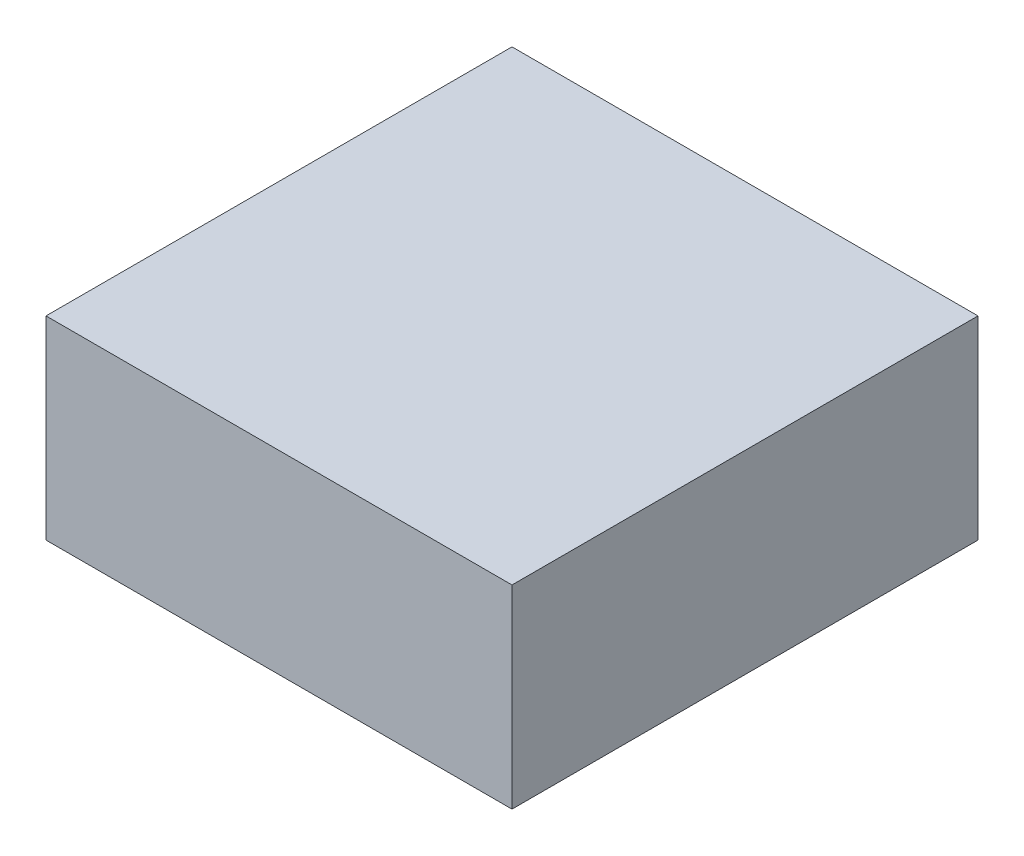
ISO-10303-21;
HEADER;
FILE_DESCRIPTION(('STEP AP214'),'2;1');
FILE_NAME('part.step','',(''),(''),'','','');
FILE_SCHEMA(('AUTOMOTIVE_DESIGN { 1 0 10303 214 1 1 1 1 }'));
ENDSEC;
DATA;
#1=APPLICATION_CONTEXT('core data for automotive mechanical design processes');
#2=APPLICATION_PROTOCOL_DEFINITION('international standard','automotive_design',2000,#1);
#3=PRODUCT_CONTEXT('',#1,'mechanical');
#4=PRODUCT('Part','Part','',(#3));
#5=PRODUCT_RELATED_PRODUCT_CATEGORY('part','',(#4));
#6=PRODUCT_DEFINITION_FORMATION('','',#4);
#7=PRODUCT_DEFINITION_CONTEXT('part definition',#1,'design');
#8=PRODUCT_DEFINITION('design','',#6,#7);
#9=PRODUCT_DEFINITION_SHAPE('','',#8);
#10=(LENGTH_UNIT() NAMED_UNIT(*) SI_UNIT(.MILLI.,.METRE.));
#11=(NAMED_UNIT(*) PLANE_ANGLE_UNIT() SI_UNIT($,.RADIAN.));
#12=(NAMED_UNIT(*) SI_UNIT($,.STERADIAN.) SOLID_ANGLE_UNIT());
#13=UNCERTAINTY_MEASURE_WITH_UNIT(LENGTH_MEASURE(1.E-05),#10,'distance_accuracy_value','');
#14=(GEOMETRIC_REPRESENTATION_CONTEXT(3) GLOBAL_UNCERTAINTY_ASSIGNED_CONTEXT((#13)) GLOBAL_UNIT_ASSIGNED_CONTEXT((#10,
#11,#12)) REPRESENTATION_CONTEXT('',''));
#15=CARTESIAN_POINT('',(0.,0.,0.));
#16=DIRECTION('',(0.,0.,1.));
#17=DIRECTION('',(1.,0.,0.));
#18=AXIS2_PLACEMENT_3D('',#15,#16,#17);
#19=CARTESIAN_POINT('',(18.,15.,-18.));
#20=DIRECTION('',(-1.,0.,0.));
#21=DIRECTION('',(0.,0.,1.));
#22=AXIS2_PLACEMENT_3D('',#19,#20,#21);
#23=PLANE('',#22);
#24=DIRECTION('',(0.,0.,-1.));
#25=VECTOR('',#24,1.);
#26=CARTESIAN_POINT('',(18.,0.,-18.));
#27=LINE('',#26,#25);
#28=CARTESIAN_POINT('',(18.,0.,18.));
#29=VERTEX_POINT('',#28);
#30=CARTESIAN_POINT('',(18.,0.,-18.));
#31=VERTEX_POINT('',#30);
#32=EDGE_CURVE('E107',#29,#31,#27,.T.);
#33=ORIENTED_EDGE('',*,*,#32,.T.);
#34=DIRECTION('',(0.,-1.,0.));
#35=VECTOR('',#34,1.);
#36=CARTESIAN_POINT('',(18.,15.,-18.));
#37=LINE('',#36,#35);
#38=CARTESIAN_POINT('',(18.,15.,-18.));
#39=VERTEX_POINT('',#38);
#40=EDGE_CURVE('E11',#39,#31,#37,.T.);
#41=ORIENTED_EDGE('',*,*,#40,.F.);
#42=DIRECTION('',(0.,0.,-1.));
#43=VECTOR('',#42,1.);
#44=CARTESIAN_POINT('',(18.,15.,-18.));
#45=LINE('',#44,#43);
#46=CARTESIAN_POINT('',(18.,15.,18.));
#47=VERTEX_POINT('',#46);
#48=EDGE_CURVE('E91',#47,#39,#45,.T.);
#49=ORIENTED_EDGE('',*,*,#48,.F.);
#50=DIRECTION('',(0.,-1.,0.));
#51=VECTOR('',#50,1.);
#52=CARTESIAN_POINT('',(18.,15.,18.));
#53=LINE('',#52,#51);
#54=EDGE_CURVE('E103',#47,#29,#53,.T.);
#55=ORIENTED_EDGE('',*,*,#54,.T.);
#56=EDGE_LOOP('',(#33,#41,#49,#55));
#57=FACE_BOUND('',#56,.T.);
#58=ADVANCED_FACE('F39',(#57),#23,.F.);
#59=CARTESIAN_POINT('',(-18.,15.,-18.));
#60=DIRECTION('',(0.,0.,1.));
#61=DIRECTION('',(1.,0.,0.));
#62=AXIS2_PLACEMENT_3D('',#59,#60,#61);
#63=PLANE('',#62);
#64=DIRECTION('',(-1.,0.,0.));
#65=VECTOR('',#64,1.);
#66=CARTESIAN_POINT('',(-18.,0.,-18.));
#67=LINE('',#66,#65);
#68=CARTESIAN_POINT('',(-18.,0.,-18.));
#69=VERTEX_POINT('',#68);
#70=EDGE_CURVE('E96',#31,#69,#67,.T.);
#71=ORIENTED_EDGE('',*,*,#70,.T.);
#72=DIRECTION('',(0.,-1.,0.));
#73=VECTOR('',#72,1.);
#74=CARTESIAN_POINT('',(-18.,15.,-18.));
#75=LINE('',#74,#73);
#76=CARTESIAN_POINT('',(-18.,15.,-18.));
#77=VERTEX_POINT('',#76);
#78=EDGE_CURVE('E48',#77,#69,#75,.T.);
#79=ORIENTED_EDGE('',*,*,#78,.F.);
#80=DIRECTION('',(-1.,0.,0.));
#81=VECTOR('',#80,1.);
#82=CARTESIAN_POINT('',(-18.,15.,-18.));
#83=LINE('',#82,#81);
#84=EDGE_CURVE('E86',#39,#77,#83,.T.);
#85=ORIENTED_EDGE('',*,*,#84,.F.);
#86=ORIENTED_EDGE('',*,*,#40,.T.);
#87=EDGE_LOOP('',(#71,#79,#85,#86));
#88=FACE_BOUND('',#87,.T.);
#89=ADVANCED_FACE('F95',(#88),#63,.F.);
#90=CARTESIAN_POINT('',(-18.,15.,-18.));
#91=DIRECTION('',(1.,0.,0.));
#92=DIRECTION('',(0.,0.,-1.));
#93=AXIS2_PLACEMENT_3D('',#90,#91,#92);
#94=PLANE('',#93);
#95=DIRECTION('',(0.,0.,1.));
#96=VECTOR('',#95,1.);
#97=CARTESIAN_POINT('',(-18.,0.,-18.));
#98=LINE('',#97,#96);
#99=CARTESIAN_POINT('',(-18.,0.,18.));
#100=VERTEX_POINT('',#99);
#101=EDGE_CURVE('E73',#69,#100,#98,.T.);
#102=ORIENTED_EDGE('',*,*,#101,.T.);
#103=DIRECTION('',(0.,-1.,0.));
#104=VECTOR('',#103,1.);
#105=CARTESIAN_POINT('',(-18.,15.,18.));
#106=LINE('',#105,#104);
#107=CARTESIAN_POINT('',(-18.,15.,18.));
#108=VERTEX_POINT('',#107);
#109=EDGE_CURVE('E98',#108,#100,#106,.T.);
#110=ORIENTED_EDGE('',*,*,#109,.F.);
#111=DIRECTION('',(0.,0.,1.));
#112=VECTOR('',#111,1.);
#113=CARTESIAN_POINT('',(-18.,15.,-18.));
#114=LINE('',#113,#112);
#115=EDGE_CURVE('E89',#77,#108,#114,.T.);
#116=ORIENTED_EDGE('',*,*,#115,.F.);
#117=ORIENTED_EDGE('',*,*,#78,.T.);
#118=EDGE_LOOP('',(#102,#110,#116,#117));
#119=FACE_BOUND('',#118,.T.);
#120=ADVANCED_FACE('F99',(#119),#94,.F.);
#121=CARTESIAN_POINT('',(-18.,15.,18.));
#122=DIRECTION('',(0.,0.,-1.));
#123=DIRECTION('',(-1.,0.,0.));
#124=AXIS2_PLACEMENT_3D('',#121,#122,#123);
#125=PLANE('',#124);
#126=DIRECTION('',(1.,0.,0.));
#127=VECTOR('',#126,1.);
#128=CARTESIAN_POINT('',(-18.,0.,18.));
#129=LINE('',#128,#127);
#130=EDGE_CURVE('E79',#100,#29,#129,.T.);
#131=ORIENTED_EDGE('',*,*,#130,.T.);
#132=ORIENTED_EDGE('',*,*,#54,.F.);
#133=DIRECTION('',(1.,0.,0.));
#134=VECTOR('',#133,1.);
#135=CARTESIAN_POINT('',(-18.,15.,18.));
#136=LINE('',#135,#134);
#137=EDGE_CURVE('E56',#108,#47,#136,.T.);
#138=ORIENTED_EDGE('',*,*,#137,.F.);
#139=ORIENTED_EDGE('',*,*,#109,.T.);
#140=EDGE_LOOP('',(#131,#132,#138,#139));
#141=FACE_BOUND('',#140,.T.);
#142=ADVANCED_FACE('F120',(#141),#125,.F.);
#143=CARTESIAN_POINT('',(0.,15.,0.));
#144=DIRECTION('',(0.,1.,0.));
#145=DIRECTION('',(0.,0.,1.));
#146=AXIS2_PLACEMENT_3D('',#143,#144,#145);
#147=PLANE('',#146);
#148=ORIENTED_EDGE('',*,*,#48,.T.);
#149=ORIENTED_EDGE('',*,*,#84,.T.);
#150=ORIENTED_EDGE('',*,*,#115,.T.);
#151=ORIENTED_EDGE('',*,*,#137,.T.);
#152=EDGE_LOOP('',(#148,#149,#150,#151));
#153=FACE_BOUND('',#152,.T.);
#154=ADVANCED_FACE('F87',(#153),#147,.T.);
#155=CARTESIAN_POINT('',(0.,0.,0.));
#156=DIRECTION('',(0.,1.,0.));
#157=DIRECTION('',(0.,0.,1.));
#158=AXIS2_PLACEMENT_3D('',#155,#156,#157);
#159=PLANE('',#158);
#160=ORIENTED_EDGE('',*,*,#32,.F.);
#161=ORIENTED_EDGE('',*,*,#130,.F.);
#162=ORIENTED_EDGE('',*,*,#101,.F.);
#163=ORIENTED_EDGE('',*,*,#70,.F.);
#164=EDGE_LOOP('',(#160,#161,#162,#163));
#165=FACE_BOUND('',#164,.T.);
#166=ADVANCED_FACE('F123',(#165),#159,.F.);
#167=CLOSED_SHELL('',(#58,#89,#120,#142,#154,#166));
#168=MANIFOLD_SOLID_BREP('B2',#167);
#169=ADVANCED_BREP_SHAPE_REPRESENTATION('',(#18,#168),#14);
#170=SHAPE_DEFINITION_REPRESENTATION(#9,#169);
ENDSEC;
END-ISO-10303-21;
